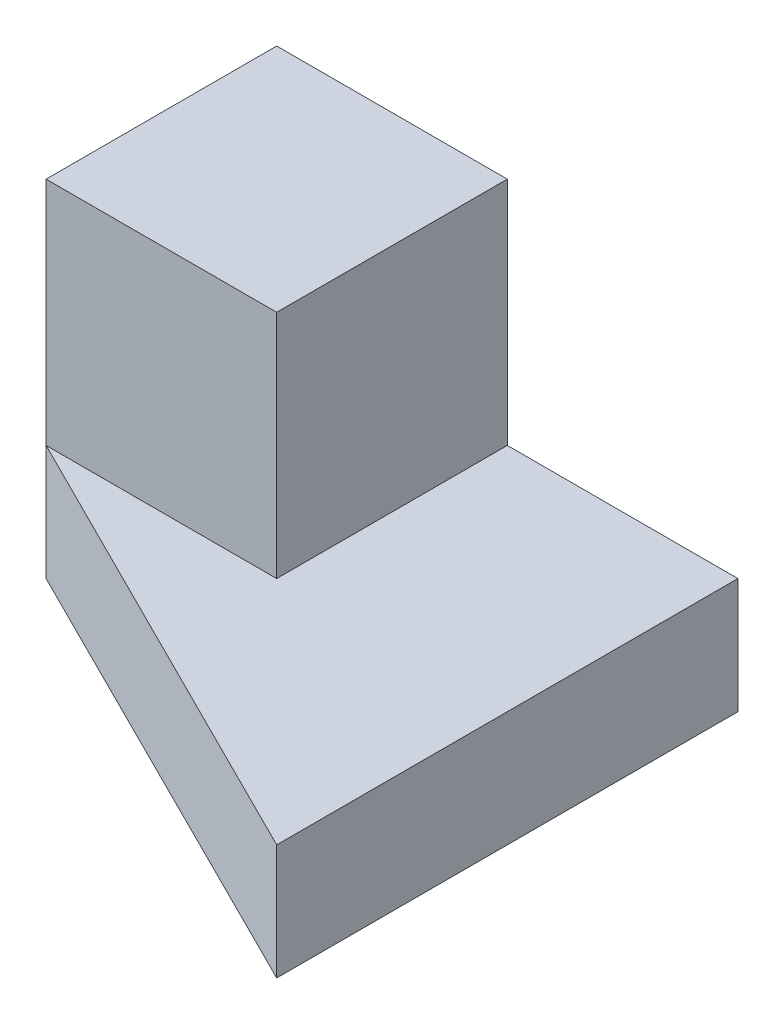
ISO-10303-21;
HEADER;
FILE_DESCRIPTION(('STEP AP214'),'2;1');
FILE_NAME('part.step','',(''),(''),'','','');
FILE_SCHEMA(('AUTOMOTIVE_DESIGN { 1 0 10303 214 1 1 1 1 }'));
ENDSEC;
DATA;
#1=APPLICATION_CONTEXT('core data for automotive mechanical design processes');
#2=APPLICATION_PROTOCOL_DEFINITION('international standard','automotive_design',2000,#1);
#3=PRODUCT_CONTEXT('',#1,'mechanical');
#4=PRODUCT('Part','Part','',(#3));
#5=PRODUCT_RELATED_PRODUCT_CATEGORY('part','',(#4));
#6=PRODUCT_DEFINITION_FORMATION('','',#4);
#7=PRODUCT_DEFINITION_CONTEXT('part definition',#1,'design');
#8=PRODUCT_DEFINITION('design','',#6,#7);
#9=PRODUCT_DEFINITION_SHAPE('','',#8);
#10=(LENGTH_UNIT() NAMED_UNIT(*) SI_UNIT(.MILLI.,.METRE.));
#11=(NAMED_UNIT(*) PLANE_ANGLE_UNIT() SI_UNIT($,.RADIAN.));
#12=(NAMED_UNIT(*) SI_UNIT($,.STERADIAN.) SOLID_ANGLE_UNIT());
#13=UNCERTAINTY_MEASURE_WITH_UNIT(LENGTH_MEASURE(1.E-05),#10,'distance_accuracy_value','');
#14=(GEOMETRIC_REPRESENTATION_CONTEXT(3) GLOBAL_UNCERTAINTY_ASSIGNED_CONTEXT((#13)) GLOBAL_UNIT_ASSIGNED_CONTEXT((#10,
#11,#12)) REPRESENTATION_CONTEXT('',''));
#15=CARTESIAN_POINT('',(0.,0.,0.));
#16=DIRECTION('',(0.,0.,1.));
#17=DIRECTION('',(1.,0.,0.));
#18=AXIS2_PLACEMENT_3D('',#15,#16,#17);
#19=CARTESIAN_POINT('',(-40.,10.,-20.));
#20=DIRECTION('',(0.447213595499958,0.,-0.894427190999916));
#21=DIRECTION('',(-0.894427190999916,0.,-0.447213595499958));
#22=AXIS2_PLACEMENT_3D('',#19,#20,#21);
#23=PLANE('',#22);
#24=DIRECTION('',(0.894427190999916,0.,0.447213595499958));
#25=VECTOR('',#24,1.);
#26=CARTESIAN_POINT('',(-40.,0.,-20.));
#27=LINE('',#26,#25);
#28=CARTESIAN_POINT('',(-40.,0.,-20.));
#29=VERTEX_POINT('',#28);
#30=CARTESIAN_POINT('',(0.,0.,0.));
#31=VERTEX_POINT('',#30);
#32=EDGE_CURVE('E127',#29,#31,#27,.T.);
#33=ORIENTED_EDGE('',*,*,#32,.T.);
#34=DIRECTION('',(0.,-1.,0.));
#35=VECTOR('',#34,1.);
#36=CARTESIAN_POINT('',(0.,10.,0.));
#37=LINE('',#36,#35);
#38=CARTESIAN_POINT('',(0.,10.,0.));
#39=VERTEX_POINT('',#38);
#40=EDGE_CURVE('E11',#39,#31,#37,.T.);
#41=ORIENTED_EDGE('',*,*,#40,.F.);
#42=DIRECTION('',(0.894427190999916,0.,0.447213595499958));
#43=VECTOR('',#42,1.);
#44=CARTESIAN_POINT('',(-40.,10.,-20.));
#45=LINE('',#44,#43);
#46=CARTESIAN_POINT('',(-40.,10.,-20.));
#47=VERTEX_POINT('',#46);
#48=EDGE_CURVE('E138',#47,#39,#45,.T.);
#49=ORIENTED_EDGE('',*,*,#48,.F.);
#50=DIRECTION('',(0.,-1.,0.));
#51=VECTOR('',#50,1.);
#52=CARTESIAN_POINT('',(-40.,10.,-20.));
#53=LINE('',#52,#51);
#54=EDGE_CURVE('E145',#47,#29,#53,.T.);
#55=ORIENTED_EDGE('',*,*,#54,.T.);
#56=EDGE_LOOP('',(#33,#41,#49,#55));
#57=FACE_BOUND('',#56,.T.);
#58=ADVANCED_FACE('F39',(#57),#23,.F.);
#59=CARTESIAN_POINT('',(0.,10.,0.));
#60=DIRECTION('',(-1.,0.,0.));
#61=DIRECTION('',(0.,0.,1.));
#62=AXIS2_PLACEMENT_3D('',#59,#60,#61);
#63=PLANE('',#62);
#64=DIRECTION('',(0.,0.,-1.));
#65=VECTOR('',#64,1.);
#66=CARTESIAN_POINT('',(0.,0.,0.));
#67=LINE('',#66,#65);
#68=CARTESIAN_POINT('',(0.,0.,-40.));
#69=VERTEX_POINT('',#68);
#70=EDGE_CURVE('E132',#31,#69,#67,.T.);
#71=ORIENTED_EDGE('',*,*,#70,.T.);
#72=DIRECTION('',(0.,-1.,0.));
#73=VECTOR('',#72,1.);
#74=CARTESIAN_POINT('',(0.,10.,-40.));
#75=LINE('',#74,#73);
#76=CARTESIAN_POINT('',(0.,10.,-40.));
#77=VERTEX_POINT('',#76);
#78=EDGE_CURVE('E47',#77,#69,#75,.T.);
#79=ORIENTED_EDGE('',*,*,#78,.F.);
#80=DIRECTION('',(0.,0.,-1.));
#81=VECTOR('',#80,1.);
#82=CARTESIAN_POINT('',(0.,10.,0.));
#83=LINE('',#82,#81);
#84=EDGE_CURVE('E86',#39,#77,#83,.T.);
#85=ORIENTED_EDGE('',*,*,#84,.F.);
#86=ORIENTED_EDGE('',*,*,#40,.T.);
#87=EDGE_LOOP('',(#71,#79,#85,#86));
#88=FACE_BOUND('',#87,.T.);
#89=ADVANCED_FACE('F188',(#88),#63,.F.);
#90=CARTESIAN_POINT('',(0.,10.,-40.));
#91=DIRECTION('',(0.,0.,1.));
#92=DIRECTION('',(1.,0.,0.));
#93=AXIS2_PLACEMENT_3D('',#90,#91,#92);
#94=PLANE('',#93);
#95=DIRECTION('',(-1.,0.,0.));
#96=VECTOR('',#95,1.);
#97=CARTESIAN_POINT('',(0.,0.,-40.));
#98=LINE('',#97,#96);
#99=CARTESIAN_POINT('',(-40.,0.,-40.));
#100=VERTEX_POINT('',#99);
#101=EDGE_CURVE('E149',#69,#100,#98,.T.);
#102=ORIENTED_EDGE('',*,*,#101,.T.);
#103=DIRECTION('',(0.,-1.,0.));
#104=VECTOR('',#103,1.);
#105=CARTESIAN_POINT('',(-40.,10.,-40.));
#106=LINE('',#105,#104);
#107=CARTESIAN_POINT('',(-40.,30.,-40.));
#108=VERTEX_POINT('',#107);
#109=EDGE_CURVE('E156',#108,#100,#106,.T.);
#110=ORIENTED_EDGE('',*,*,#109,.F.);
#111=DIRECTION('',(-1.,0.,0.));
#112=VECTOR('',#111,1.);
#113=CARTESIAN_POINT('',(-40.,30.,-40.));
#114=LINE('',#113,#112);
#115=CARTESIAN_POINT('',(-20.,30.,-40.));
#116=VERTEX_POINT('',#115);
#117=EDGE_CURVE('E113',#116,#108,#114,.T.);
#118=ORIENTED_EDGE('',*,*,#117,.F.);
#119=DIRECTION('',(0.,-1.,0.));
#120=VECTOR('',#119,1.);
#121=CARTESIAN_POINT('',(-20.,30.,-40.));
#122=LINE('',#121,#120);
#123=CARTESIAN_POINT('',(-20.,10.,-40.));
#124=VERTEX_POINT('',#123);
#125=EDGE_CURVE('E108',#116,#124,#122,.T.);
#126=ORIENTED_EDGE('',*,*,#125,.T.);
#127=DIRECTION('',(-1.,0.,0.));
#128=VECTOR('',#127,1.);
#129=CARTESIAN_POINT('',(0.,10.,-40.));
#130=LINE('',#129,#128);
#131=EDGE_CURVE('E143',#77,#124,#130,.T.);
#132=ORIENTED_EDGE('',*,*,#131,.F.);
#133=ORIENTED_EDGE('',*,*,#78,.T.);
#134=EDGE_LOOP('',(#102,#110,#118,#126,#132,#133));
#135=FACE_BOUND('',#134,.T.);
#136=ADVANCED_FACE('F163',(#135),#94,.F.);
#137=CARTESIAN_POINT('',(-40.,10.,-40.));
#138=DIRECTION('',(1.,0.,0.));
#139=DIRECTION('',(0.,0.,-1.));
#140=AXIS2_PLACEMENT_3D('',#137,#138,#139);
#141=PLANE('',#140);
#142=DIRECTION('',(0.,0.,1.));
#143=VECTOR('',#142,1.);
#144=CARTESIAN_POINT('',(-40.,0.,-40.));
#145=LINE('',#144,#143);
#146=EDGE_CURVE('E81',#100,#29,#145,.T.);
#147=ORIENTED_EDGE('',*,*,#146,.T.);
#148=ORIENTED_EDGE('',*,*,#54,.F.);
#149=DIRECTION('',(0.,-1.,0.));
#150=VECTOR('',#149,1.);
#151=CARTESIAN_POINT('',(-40.,30.,-20.));
#152=LINE('',#151,#150);
#153=CARTESIAN_POINT('',(-40.,30.,-20.));
#154=VERTEX_POINT('',#153);
#155=EDGE_CURVE('E134',#154,#47,#152,.T.);
#156=ORIENTED_EDGE('',*,*,#155,.F.);
#157=DIRECTION('',(0.,0.,1.));
#158=VECTOR('',#157,1.);
#159=CARTESIAN_POINT('',(-40.,30.,-20.));
#160=LINE('',#159,#158);
#161=EDGE_CURVE('E119',#108,#154,#160,.T.);
#162=ORIENTED_EDGE('',*,*,#161,.F.);
#163=ORIENTED_EDGE('',*,*,#109,.T.);
#164=EDGE_LOOP('',(#147,#148,#156,#162,#163));
#165=FACE_BOUND('',#164,.T.);
#166=ADVANCED_FACE('F170',(#165),#141,.F.);
#167=CARTESIAN_POINT('',(0.,10.,0.));
#168=DIRECTION('',(0.,1.,0.));
#169=DIRECTION('',(0.,0.,1.));
#170=AXIS2_PLACEMENT_3D('',#167,#168,#169);
#171=PLANE('',#170);
#172=DIRECTION('',(1.,0.,0.));
#173=VECTOR('',#172,1.);
#174=CARTESIAN_POINT('',(-20.,10.,-20.));
#175=LINE('',#174,#173);
#176=CARTESIAN_POINT('',(-20.,10.,-20.));
#177=VERTEX_POINT('',#176);
#178=EDGE_CURVE('E60',#47,#177,#175,.T.);
#179=ORIENTED_EDGE('',*,*,#178,.F.);
#180=ORIENTED_EDGE('',*,*,#48,.T.);
#181=ORIENTED_EDGE('',*,*,#84,.T.);
#182=ORIENTED_EDGE('',*,*,#131,.T.);
#183=DIRECTION('',(0.,0.,-1.));
#184=VECTOR('',#183,1.);
#185=CARTESIAN_POINT('',(-20.,10.,-40.));
#186=LINE('',#185,#184);
#187=EDGE_CURVE('E54',#177,#124,#186,.T.);
#188=ORIENTED_EDGE('',*,*,#187,.F.);
#189=EDGE_LOOP('',(#179,#180,#181,#182,#188));
#190=FACE_BOUND('',#189,.T.);
#191=ADVANCED_FACE('F181',(#190),#171,.T.);
#192=CARTESIAN_POINT('',(0.,0.,0.));
#193=DIRECTION('',(0.,1.,0.));
#194=DIRECTION('',(0.,0.,1.));
#195=AXIS2_PLACEMENT_3D('',#192,#193,#194);
#196=PLANE('',#195);
#197=ORIENTED_EDGE('',*,*,#32,.F.);
#198=ORIENTED_EDGE('',*,*,#146,.F.);
#199=ORIENTED_EDGE('',*,*,#101,.F.);
#200=ORIENTED_EDGE('',*,*,#70,.F.);
#201=EDGE_LOOP('',(#197,#198,#199,#200));
#202=FACE_BOUND('',#201,.T.);
#203=ADVANCED_FACE('F166',(#202),#196,.F.);
#204=CARTESIAN_POINT('',(-20.,30.,-20.));
#205=DIRECTION('',(0.,0.,-1.));
#206=DIRECTION('',(-1.,0.,0.));
#207=AXIS2_PLACEMENT_3D('',#204,#205,#206);
#208=PLANE('',#207);
#209=ORIENTED_EDGE('',*,*,#178,.T.);
#210=DIRECTION('',(0.,-1.,0.));
#211=VECTOR('',#210,1.);
#212=CARTESIAN_POINT('',(-20.,30.,-20.));
#213=LINE('',#212,#211);
#214=CARTESIAN_POINT('',(-20.,30.,-20.));
#215=VERTEX_POINT('',#214);
#216=EDGE_CURVE('E106',#215,#177,#213,.T.);
#217=ORIENTED_EDGE('',*,*,#216,.F.);
#218=DIRECTION('',(1.,0.,0.));
#219=VECTOR('',#218,1.);
#220=CARTESIAN_POINT('',(-20.,30.,-20.));
#221=LINE('',#220,#219);
#222=EDGE_CURVE('E114',#154,#215,#221,.T.);
#223=ORIENTED_EDGE('',*,*,#222,.F.);
#224=ORIENTED_EDGE('',*,*,#155,.T.);
#225=EDGE_LOOP('',(#209,#217,#223,#224));
#226=FACE_BOUND('',#225,.T.);
#227=ADVANCED_FACE('F125',(#226),#208,.F.);
#228=CARTESIAN_POINT('',(-20.,30.,-40.));
#229=DIRECTION('',(-1.,0.,0.));
#230=DIRECTION('',(0.,0.,1.));
#231=AXIS2_PLACEMENT_3D('',#228,#229,#230);
#232=PLANE('',#231);
#233=ORIENTED_EDGE('',*,*,#187,.T.);
#234=ORIENTED_EDGE('',*,*,#125,.F.);
#235=DIRECTION('',(0.,0.,-1.));
#236=VECTOR('',#235,1.);
#237=CARTESIAN_POINT('',(-20.,30.,-40.));
#238=LINE('',#237,#236);
#239=EDGE_CURVE('E102',#215,#116,#238,.T.);
#240=ORIENTED_EDGE('',*,*,#239,.F.);
#241=ORIENTED_EDGE('',*,*,#216,.T.);
#242=EDGE_LOOP('',(#233,#234,#240,#241));
#243=FACE_BOUND('',#242,.T.);
#244=ADVANCED_FACE('F104',(#243),#232,.F.);
#245=CARTESIAN_POINT('',(0.,30.,0.));
#246=DIRECTION('',(0.,-1.,0.));
#247=DIRECTION('',(0.,0.,-1.));
#248=AXIS2_PLACEMENT_3D('',#245,#246,#247);
#249=PLANE('',#248);
#250=ORIENTED_EDGE('',*,*,#222,.T.);
#251=ORIENTED_EDGE('',*,*,#239,.T.);
#252=ORIENTED_EDGE('',*,*,#117,.T.);
#253=ORIENTED_EDGE('',*,*,#161,.T.);
#254=EDGE_LOOP('',(#250,#251,#252,#253));
#255=FACE_BOUND('',#254,.T.);
#256=ADVANCED_FACE('F117',(#255),#249,.F.);
#257=CLOSED_SHELL('',(#58,#89,#136,#166,#191,#203,#227,#244,#256));
#258=MANIFOLD_SOLID_BREP('B2',#257);
#259=ADVANCED_BREP_SHAPE_REPRESENTATION('',(#18,#258),#14);
#260=SHAPE_DEFINITION_REPRESENTATION(#9,#259);
ENDSEC;
END-ISO-10303-21;
